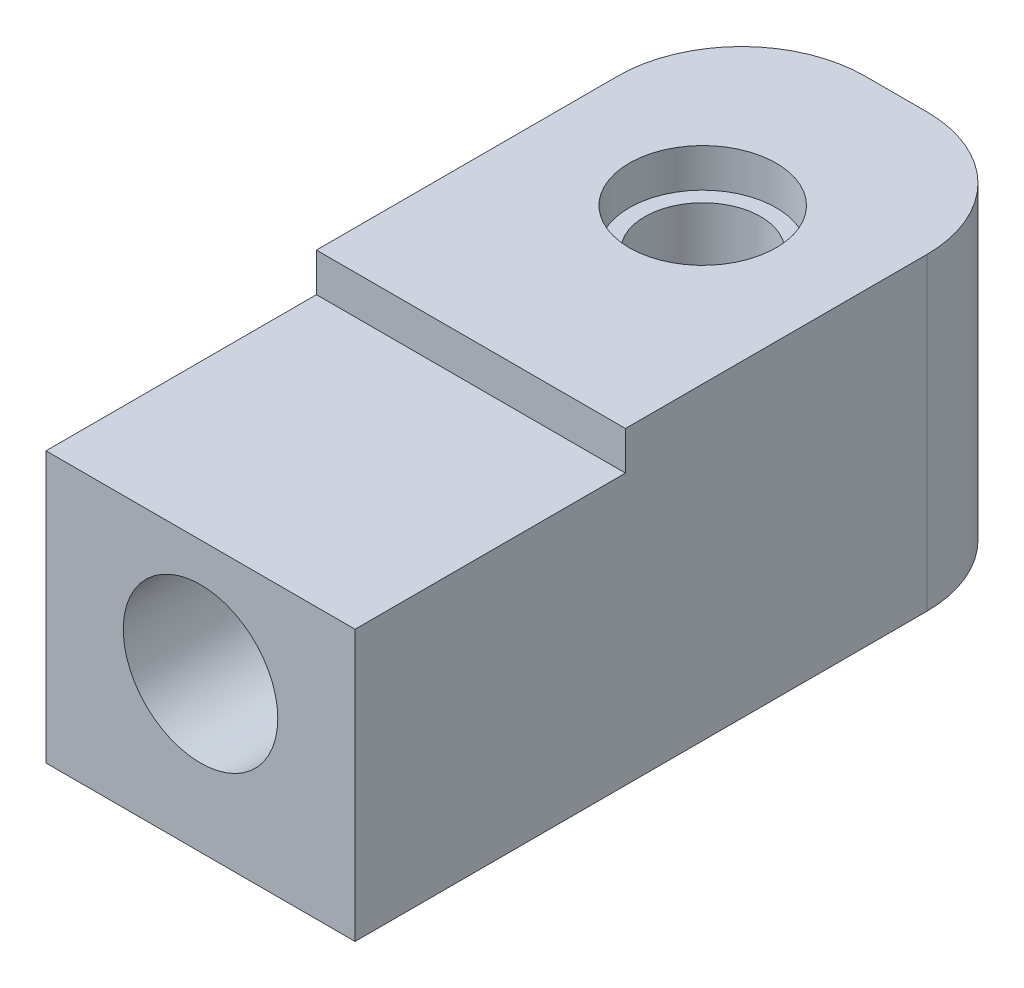
ISO-10303-21;
HEADER;
FILE_DESCRIPTION(('STEP AP214'),'2;1');
FILE_NAME('part.step','',(''),(''),'','','');
FILE_SCHEMA(('AUTOMOTIVE_DESIGN { 1 0 10303 214 1 1 1 1 }'));
ENDSEC;
DATA;
#1=APPLICATION_CONTEXT('core data for automotive mechanical design processes');
#2=APPLICATION_PROTOCOL_DEFINITION('international standard','automotive_design',2000,#1);
#3=PRODUCT_CONTEXT('',#1,'mechanical');
#4=PRODUCT('Part','Part','',(#3));
#5=PRODUCT_RELATED_PRODUCT_CATEGORY('part','',(#4));
#6=PRODUCT_DEFINITION_FORMATION('','',#4);
#7=PRODUCT_DEFINITION_CONTEXT('part definition',#1,'design');
#8=PRODUCT_DEFINITION('design','',#6,#7);
#9=PRODUCT_DEFINITION_SHAPE('','',#8);
#10=(LENGTH_UNIT() NAMED_UNIT(*) SI_UNIT(.MILLI.,.METRE.));
#11=(NAMED_UNIT(*) PLANE_ANGLE_UNIT() SI_UNIT($,.RADIAN.));
#12=(NAMED_UNIT(*) SI_UNIT($,.STERADIAN.) SOLID_ANGLE_UNIT());
#13=UNCERTAINTY_MEASURE_WITH_UNIT(LENGTH_MEASURE(1.E-05),#10,'distance_accuracy_value','');
#14=(GEOMETRIC_REPRESENTATION_CONTEXT(3) GLOBAL_UNCERTAINTY_ASSIGNED_CONTEXT((#13)) GLOBAL_UNIT_ASSIGNED_CONTEXT((#10,
#11,#12)) REPRESENTATION_CONTEXT('',''));
#15=CARTESIAN_POINT('',(0.,0.,0.));
#16=DIRECTION('',(0.,0.,1.));
#17=DIRECTION('',(1.,0.,0.));
#18=AXIS2_PLACEMENT_3D('',#15,#16,#17);
#19=CARTESIAN_POINT('',(5.,10.,-7.24999999999999));
#20=DIRECTION('',(-1.,0.,0.));
#21=DIRECTION('',(0.,0.,1.));
#22=AXIS2_PLACEMENT_3D('',#19,#20,#21);
#23=PLANE('',#22);
#24=DIRECTION('',(0.,0.,-1.));
#25=VECTOR('',#24,1.);
#26=CARTESIAN_POINT('',(5.,10.,-7.24999999999999));
#27=LINE('',#26,#25);
#28=CARTESIAN_POINT('',(5.,10.,2.50000000000001));
#29=VERTEX_POINT('',#28);
#30=CARTESIAN_POINT('',(5.,10.,-7.24999999999999));
#31=VERTEX_POINT('',#30);
#32=EDGE_CURVE('E90',#29,#31,#27,.T.);
#33=ORIENTED_EDGE('',*,*,#32,.F.);
#34=DIRECTION('',(0.,1.,0.));
#35=VECTOR('',#34,1.);
#36=CARTESIAN_POINT('',(5.,8.75,2.50000000000001));
#37=LINE('',#36,#35);
#38=CARTESIAN_POINT('',(5.,8.75,2.50000000000001));
#39=VERTEX_POINT('',#38);
#40=EDGE_CURVE('E47',#39,#29,#37,.T.);
#41=ORIENTED_EDGE('',*,*,#40,.F.);
#42=DIRECTION('',(0.,0.,-1.));
#43=VECTOR('',#42,1.);
#44=CARTESIAN_POINT('',(5.,8.75,11.25));
#45=LINE('',#44,#43);
#46=CARTESIAN_POINT('',(5.,8.75,11.25));
#47=VERTEX_POINT('',#46);
#48=EDGE_CURVE('E122',#47,#39,#45,.T.);
#49=ORIENTED_EDGE('',*,*,#48,.F.);
#50=DIRECTION('',(0.,-1.,0.));
#51=VECTOR('',#50,1.);
#52=CARTESIAN_POINT('',(5.,10.,11.25));
#53=LINE('',#52,#51);
#54=CARTESIAN_POINT('',(5.,0.,11.25));
#55=VERTEX_POINT('',#54);
#56=EDGE_CURVE('E84',#47,#55,#53,.T.);
#57=ORIENTED_EDGE('',*,*,#56,.T.);
#58=DIRECTION('',(0.,0.,-1.));
#59=VECTOR('',#58,1.);
#60=CARTESIAN_POINT('',(5.,0.,-7.24999999999999));
#61=LINE('',#60,#59);
#62=CARTESIAN_POINT('',(5.,0.,-7.24999999999999));
#63=VERTEX_POINT('',#62);
#64=EDGE_CURVE('E156',#55,#63,#61,.T.);
#65=ORIENTED_EDGE('',*,*,#64,.T.);
#66=DIRECTION('',(0.,-1.,0.));
#67=VECTOR('',#66,1.);
#68=CARTESIAN_POINT('',(5.,10.,-7.24999999999999));
#69=LINE('',#68,#67);
#70=EDGE_CURVE('E11',#31,#63,#69,.T.);
#71=ORIENTED_EDGE('',*,*,#70,.F.);
#72=EDGE_LOOP('',(#33,#41,#49,#57,#65,#71));
#73=FACE_BOUND('',#72,.T.);
#74=ADVANCED_FACE('F33',(#73),#23,.F.);
#75=CARTESIAN_POINT('',(0.999999999999997,10.,-7.24999999999999));
#76=DIRECTION('',(0.,-1.,0.));
#77=DIRECTION('',(0.,0.,-1.));
#78=AXIS2_PLACEMENT_3D('',#75,#76,#77);
#79=CYLINDRICAL_SURFACE('',#78,4.);
#80=CARTESIAN_POINT('',(0.999999999999997,0.,-7.24999999999999));
#81=DIRECTION('',(0.,1.,0.));
#82=DIRECTION('',(0.,0.,1.));
#83=AXIS2_PLACEMENT_3D('',#80,#81,#82);
#84=CIRCLE('',#83,4.);
#85=CARTESIAN_POINT('',(0.999999999999997,0.,-11.25));
#86=VERTEX_POINT('',#85);
#87=EDGE_CURVE('E152',#63,#86,#84,.T.);
#88=ORIENTED_EDGE('',*,*,#87,.T.);
#89=DIRECTION('',(0.,-1.,0.));
#90=VECTOR('',#89,1.);
#91=CARTESIAN_POINT('',(0.999999999999997,10.,-11.25));
#92=LINE('',#91,#90);
#93=CARTESIAN_POINT('',(0.999999999999997,10.,-11.25));
#94=VERTEX_POINT('',#93);
#95=EDGE_CURVE('E40',#94,#86,#92,.T.);
#96=ORIENTED_EDGE('',*,*,#95,.F.);
#97=CARTESIAN_POINT('',(0.999999999999997,10.,-7.24999999999999));
#98=DIRECTION('',(0.,1.,0.));
#99=DIRECTION('',(0.,0.,1.));
#100=AXIS2_PLACEMENT_3D('',#97,#98,#99);
#101=CIRCLE('',#100,4.);
#102=EDGE_CURVE('E161',#31,#94,#101,.T.);
#103=ORIENTED_EDGE('',*,*,#102,.F.);
#104=ORIENTED_EDGE('',*,*,#70,.T.);
#105=EDGE_LOOP('',(#88,#96,#103,#104));
#106=FACE_BOUND('',#105,.T.);
#107=ADVANCED_FACE('F198',(#106),#79,.T.);
#108=CARTESIAN_POINT('',(-0.999999999999997,10.,-11.25));
#109=DIRECTION('',(0.,0.,1.));
#110=DIRECTION('',(1.,0.,0.));
#111=AXIS2_PLACEMENT_3D('',#108,#109,#110);
#112=PLANE('',#111);
#113=DIRECTION('',(-1.,0.,0.));
#114=VECTOR('',#113,1.);
#115=CARTESIAN_POINT('',(-0.999999999999997,0.,-11.25));
#116=LINE('',#115,#114);
#117=CARTESIAN_POINT('',(-0.999999999999997,0.,-11.25));
#118=VERTEX_POINT('',#117);
#119=EDGE_CURVE('E145',#86,#118,#116,.T.);
#120=ORIENTED_EDGE('',*,*,#119,.T.);
#121=DIRECTION('',(0.,-1.,0.));
#122=VECTOR('',#121,1.);
#123=CARTESIAN_POINT('',(-0.999999999999997,10.,-11.25));
#124=LINE('',#123,#122);
#125=CARTESIAN_POINT('',(-0.999999999999997,10.,-11.25));
#126=VERTEX_POINT('',#125);
#127=EDGE_CURVE('E131',#126,#118,#124,.T.);
#128=ORIENTED_EDGE('',*,*,#127,.F.);
#129=DIRECTION('',(-1.,0.,0.));
#130=VECTOR('',#129,1.);
#131=CARTESIAN_POINT('',(-0.999999999999997,10.,-11.25));
#132=LINE('',#131,#130);
#133=EDGE_CURVE('E146',#94,#126,#132,.T.);
#134=ORIENTED_EDGE('',*,*,#133,.F.);
#135=ORIENTED_EDGE('',*,*,#95,.T.);
#136=EDGE_LOOP('',(#120,#128,#134,#135));
#137=FACE_BOUND('',#136,.T.);
#138=ADVANCED_FACE('F143',(#137),#112,.F.);
#139=CARTESIAN_POINT('',(-0.999999999999997,10.,-7.24999999999999));
#140=DIRECTION('',(0.,-1.,0.));
#141=DIRECTION('',(0.,0.,-1.));
#142=AXIS2_PLACEMENT_3D('',#139,#140,#141);
#143=CYLINDRICAL_SURFACE('',#142,4.);
#144=CARTESIAN_POINT('',(-0.999999999999997,0.,-7.24999999999999));
#145=DIRECTION('',(0.,1.,0.));
#146=DIRECTION('',(0.,0.,-1.));
#147=AXIS2_PLACEMENT_3D('',#144,#145,#146);
#148=CIRCLE('',#147,4.);
#149=CARTESIAN_POINT('',(-5.,0.,-7.24999999999999));
#150=VERTEX_POINT('',#149);
#151=EDGE_CURVE('E153',#118,#150,#148,.T.);
#152=ORIENTED_EDGE('',*,*,#151,.T.);
#153=DIRECTION('',(0.,-1.,0.));
#154=VECTOR('',#153,1.);
#155=CARTESIAN_POINT('',(-5.,10.,-7.24999999999999));
#156=LINE('',#155,#154);
#157=CARTESIAN_POINT('',(-5.,10.,-7.24999999999999));
#158=VERTEX_POINT('',#157);
#159=EDGE_CURVE('E129',#158,#150,#156,.T.);
#160=ORIENTED_EDGE('',*,*,#159,.F.);
#161=CARTESIAN_POINT('',(-0.999999999999997,10.,-7.24999999999999));
#162=DIRECTION('',(0.,1.,0.));
#163=DIRECTION('',(0.,0.,-1.));
#164=AXIS2_PLACEMENT_3D('',#161,#162,#163);
#165=CIRCLE('',#164,4.);
#166=EDGE_CURVE('E56',#126,#158,#165,.T.);
#167=ORIENTED_EDGE('',*,*,#166,.F.);
#168=ORIENTED_EDGE('',*,*,#127,.T.);
#169=EDGE_LOOP('',(#152,#160,#167,#168));
#170=FACE_BOUND('',#169,.T.);
#171=ADVANCED_FACE('F201',(#170),#143,.T.);
#172=CARTESIAN_POINT('',(-5.,10.,-7.24999999999999));
#173=DIRECTION('',(1.,0.,0.));
#174=DIRECTION('',(0.,0.,-1.));
#175=AXIS2_PLACEMENT_3D('',#172,#173,#174);
#176=PLANE('',#175);
#177=DIRECTION('',(0.,0.,1.));
#178=VECTOR('',#177,1.);
#179=CARTESIAN_POINT('',(-5.,8.75,11.25));
#180=LINE('',#179,#178);
#181=CARTESIAN_POINT('',(-5.,8.75,2.50000000000001));
#182=VERTEX_POINT('',#181);
#183=CARTESIAN_POINT('',(-5.,8.75,11.25));
#184=VERTEX_POINT('',#183);
#185=EDGE_CURVE('E108',#182,#184,#180,.T.);
#186=ORIENTED_EDGE('',*,*,#185,.F.);
#187=DIRECTION('',(0.,1.,0.));
#188=VECTOR('',#187,1.);
#189=CARTESIAN_POINT('',(-5.,8.75,2.50000000000001));
#190=LINE('',#189,#188);
#191=CARTESIAN_POINT('',(-5.,10.,2.50000000000001));
#192=VERTEX_POINT('',#191);
#193=EDGE_CURVE('E170',#182,#192,#190,.T.);
#194=ORIENTED_EDGE('',*,*,#193,.T.);
#195=DIRECTION('',(0.,0.,1.));
#196=VECTOR('',#195,1.);
#197=CARTESIAN_POINT('',(-5.,10.,-7.24999999999999));
#198=LINE('',#197,#196);
#199=EDGE_CURVE('E133',#158,#192,#198,.T.);
#200=ORIENTED_EDGE('',*,*,#199,.F.);
#201=ORIENTED_EDGE('',*,*,#159,.T.);
#202=DIRECTION('',(0.,0.,1.));
#203=VECTOR('',#202,1.);
#204=CARTESIAN_POINT('',(-5.,0.,-7.24999999999999));
#205=LINE('',#204,#203);
#206=CARTESIAN_POINT('',(-5.,0.,11.25));
#207=VERTEX_POINT('',#206);
#208=EDGE_CURVE('E127',#150,#207,#205,.T.);
#209=ORIENTED_EDGE('',*,*,#208,.T.);
#210=DIRECTION('',(0.,-1.,0.));
#211=VECTOR('',#210,1.);
#212=CARTESIAN_POINT('',(-5.,10.,11.25));
#213=LINE('',#212,#211);
#214=EDGE_CURVE('E120',#184,#207,#213,.T.);
#215=ORIENTED_EDGE('',*,*,#214,.F.);
#216=EDGE_LOOP('',(#186,#194,#200,#201,#209,#215));
#217=FACE_BOUND('',#216,.T.);
#218=ADVANCED_FACE('F124',(#217),#176,.F.);
#219=CARTESIAN_POINT('',(-5.,10.,11.25));
#220=DIRECTION('',(0.,0.,-1.));
#221=DIRECTION('',(-1.,0.,0.));
#222=AXIS2_PLACEMENT_3D('',#219,#220,#221);
#223=PLANE('',#222);
#224=CARTESIAN_POINT('',(0.,5.,11.25));
#225=DIRECTION('',(0.,0.,1.));
#226=DIRECTION('',(1.,0.,0.));
#227=AXIS2_PLACEMENT_3D('',#224,#225,#226);
#228=CIRCLE('',#227,2.5);
#229=CARTESIAN_POINT('',(2.5,5.,11.25));
#230=VERTEX_POINT('',#229);
#231=EDGE_CURVE('E194',#230,#230,#228,.T.);
#232=ORIENTED_EDGE('',*,*,#231,.F.);
#233=EDGE_LOOP('',(#232));
#234=FACE_BOUND('',#233,.T.);
#235=ORIENTED_EDGE('',*,*,#56,.F.);
#236=DIRECTION('',(1.,0.,0.));
#237=VECTOR('',#236,1.);
#238=CARTESIAN_POINT('',(-5.,8.75,11.25));
#239=LINE('',#238,#237);
#240=EDGE_CURVE('E111',#184,#47,#239,.T.);
#241=ORIENTED_EDGE('',*,*,#240,.F.);
#242=ORIENTED_EDGE('',*,*,#214,.T.);
#243=DIRECTION('',(1.,0.,0.));
#244=VECTOR('',#243,1.);
#245=CARTESIAN_POINT('',(-5.,0.,11.25));
#246=LINE('',#245,#244);
#247=EDGE_CURVE('E160',#207,#55,#246,.T.);
#248=ORIENTED_EDGE('',*,*,#247,.T.);
#249=EDGE_LOOP('',(#235,#241,#242,#248));
#250=FACE_BOUND('',#249,.T.);
#251=ADVANCED_FACE('F119',(#234,#250),#223,.F.);
#252=CARTESIAN_POINT('',(-0.999999999999997,10.,-7.24999999999999));
#253=DIRECTION('',(0.,-1.,0.));
#254=DIRECTION('',(0.,0.,-1.));
#255=AXIS2_PLACEMENT_3D('',#252,#253,#254);
#256=PLANE('',#255);
#257=CARTESIAN_POINT('',(0.,10.,-4.99999999999999));
#258=DIRECTION('',(0.,1.,0.));
#259=DIRECTION('',(0.,0.,1.));
#260=AXIS2_PLACEMENT_3D('',#257,#258,#259);
#261=CIRCLE('',#260,2.375);
#262=CARTESIAN_POINT('',(0.,10.,-2.62499999999999));
#263=VERTEX_POINT('',#262);
#264=EDGE_CURVE('E165',#263,#263,#261,.T.);
#265=ORIENTED_EDGE('',*,*,#264,.F.);
#266=EDGE_LOOP('',(#265));
#267=FACE_BOUND('',#266,.T.);
#268=ORIENTED_EDGE('',*,*,#199,.T.);
#269=DIRECTION('',(-1.,0.,0.));
#270=VECTOR('',#269,1.);
#271=CARTESIAN_POINT('',(-5.,10.,2.50000000000001));
#272=LINE('',#271,#270);
#273=EDGE_CURVE('E116',#29,#192,#272,.T.);
#274=ORIENTED_EDGE('',*,*,#273,.F.);
#275=ORIENTED_EDGE('',*,*,#32,.T.);
#276=ORIENTED_EDGE('',*,*,#102,.T.);
#277=ORIENTED_EDGE('',*,*,#133,.T.);
#278=ORIENTED_EDGE('',*,*,#166,.T.);
#279=EDGE_LOOP('',(#268,#274,#275,#276,#277,#278));
#280=FACE_BOUND('',#279,.T.);
#281=ADVANCED_FACE('F199',(#267,#280),#256,.F.);
#282=CARTESIAN_POINT('',(-0.999999999999997,0.,-7.24999999999999));
#283=DIRECTION('',(0.,-1.,0.));
#284=DIRECTION('',(0.,0.,-1.));
#285=AXIS2_PLACEMENT_3D('',#282,#283,#284);
#286=PLANE('',#285);
#287=CARTESIAN_POINT('',(0.,0.,-4.99999999999999));
#288=DIRECTION('',(0.,-1.,0.));
#289=DIRECTION('',(0.,0.,-1.));
#290=AXIS2_PLACEMENT_3D('',#287,#288,#289);
#291=CIRCLE('',#290,1.875);
#292=CARTESIAN_POINT('',(0.,0.,-6.87499999999999));
#293=VERTEX_POINT('',#292);
#294=EDGE_CURVE('E186',#293,#293,#291,.F.);
#295=ORIENTED_EDGE('',*,*,#294,.T.);
#296=EDGE_LOOP('',(#295));
#297=FACE_BOUND('',#296,.T.);
#298=ORIENTED_EDGE('',*,*,#64,.F.);
#299=ORIENTED_EDGE('',*,*,#247,.F.);
#300=ORIENTED_EDGE('',*,*,#208,.F.);
#301=ORIENTED_EDGE('',*,*,#151,.F.);
#302=ORIENTED_EDGE('',*,*,#119,.F.);
#303=ORIENTED_EDGE('',*,*,#87,.F.);
#304=EDGE_LOOP('',(#298,#299,#300,#301,#302,#303));
#305=FACE_BOUND('',#304,.T.);
#306=ADVANCED_FACE('F151',(#297,#305),#286,.T.);
#307=CARTESIAN_POINT('',(0.,8.75,-4.99999999999999));
#308=DIRECTION('',(0.,1.,0.));
#309=DIRECTION('',(0.,0.,1.));
#310=AXIS2_PLACEMENT_3D('',#307,#308,#309);
#311=CYLINDRICAL_SURFACE('',#310,2.375);
#312=CARTESIAN_POINT('',(0.,8.75,-4.99999999999999));
#313=DIRECTION('',(0.,1.,0.));
#314=DIRECTION('',(0.,0.,1.));
#315=AXIS2_PLACEMENT_3D('',#312,#313,#314);
#316=CIRCLE('',#315,2.375);
#317=CARTESIAN_POINT('',(0.,8.75,-2.62499999999999));
#318=VERTEX_POINT('',#317);
#319=EDGE_CURVE('E177',#318,#318,#316,.T.);
#320=ORIENTED_EDGE('',*,*,#319,.F.);
#321=EDGE_LOOP('',(#320));
#322=FACE_BOUND('',#321,.T.);
#323=ORIENTED_EDGE('',*,*,#264,.T.);
#324=EDGE_LOOP('',(#323));
#325=FACE_BOUND('',#324,.T.);
#326=ADVANCED_FACE('F252',(#322,#325),#311,.F.);
#327=CARTESIAN_POINT('',(0.,8.75,-4.99999999999999));
#328=DIRECTION('',(0.,1.,0.));
#329=DIRECTION('',(0.,0.,1.));
#330=AXIS2_PLACEMENT_3D('',#327,#328,#329);
#331=PLANE('',#330);
#332=CARTESIAN_POINT('',(0.,8.75,-4.99999999999999));
#333=DIRECTION('',(0.,1.,0.));
#334=DIRECTION('',(0.,0.,1.));
#335=AXIS2_PLACEMENT_3D('',#332,#333,#334);
#336=CIRCLE('',#335,1.875);
#337=CARTESIAN_POINT('',(0.,8.75,-3.12499999999999));
#338=VERTEX_POINT('',#337);
#339=EDGE_CURVE('E182',#338,#338,#336,.T.);
#340=ORIENTED_EDGE('',*,*,#339,.F.);
#341=EDGE_LOOP('',(#340));
#342=FACE_BOUND('',#341,.T.);
#343=ORIENTED_EDGE('',*,*,#319,.T.);
#344=EDGE_LOOP('',(#343));
#345=FACE_BOUND('',#344,.T.);
#346=ADVANCED_FACE('F257',(#342,#345),#331,.T.);
#347=CARTESIAN_POINT('',(-5.,8.75,2.50000000000001));
#348=DIRECTION('',(0.,0.,-1.));
#349=DIRECTION('',(-1.,0.,0.));
#350=AXIS2_PLACEMENT_3D('',#347,#348,#349);
#351=PLANE('',#350);
#352=ORIENTED_EDGE('',*,*,#273,.T.);
#353=ORIENTED_EDGE('',*,*,#193,.F.);
#354=DIRECTION('',(-1.,0.,0.));
#355=VECTOR('',#354,1.);
#356=CARTESIAN_POINT('',(-5.,8.75,2.50000000000001));
#357=LINE('',#356,#355);
#358=EDGE_CURVE('E112',#39,#182,#357,.T.);
#359=ORIENTED_EDGE('',*,*,#358,.F.);
#360=ORIENTED_EDGE('',*,*,#40,.T.);
#361=EDGE_LOOP('',(#352,#353,#359,#360));
#362=FACE_BOUND('',#361,.T.);
#363=ADVANCED_FACE('F197',(#362),#351,.F.);
#364=CARTESIAN_POINT('',(0.,8.75,0.));
#365=DIRECTION('',(0.,-1.,0.));
#366=DIRECTION('',(0.,0.,-1.));
#367=AXIS2_PLACEMENT_3D('',#364,#365,#366);
#368=PLANE('',#367);
#369=ORIENTED_EDGE('',*,*,#185,.T.);
#370=ORIENTED_EDGE('',*,*,#240,.T.);
#371=ORIENTED_EDGE('',*,*,#48,.T.);
#372=ORIENTED_EDGE('',*,*,#358,.T.);
#373=EDGE_LOOP('',(#369,#370,#371,#372));
#374=FACE_BOUND('',#373,.T.);
#375=ADVANCED_FACE('F110',(#374),#368,.F.);
#376=CARTESIAN_POINT('',(0.,-0.000999999999999265,-4.99999999999999));
#377=DIRECTION('',(0.,1.,0.));
#378=DIRECTION('',(0.,0.,1.));
#379=AXIS2_PLACEMENT_3D('',#376,#377,#378);
#380=CYLINDRICAL_SURFACE('',#379,1.875);
#381=ORIENTED_EDGE('',*,*,#294,.F.);
#382=EDGE_LOOP('',(#381));
#383=FACE_BOUND('',#382,.T.);
#384=ORIENTED_EDGE('',*,*,#339,.T.);
#385=EDGE_LOOP('',(#384));
#386=FACE_BOUND('',#385,.T.);
#387=ADVANCED_FACE('F277',(#383,#386),#380,.F.);
#388=CARTESIAN_POINT('',(0.,5.,-0.62999999999999));
#389=DIRECTION('',(0.,0.,1.));
#390=DIRECTION('',(1.,0.,0.));
#391=AXIS2_PLACEMENT_3D('',#388,#389,#390);
#392=CYLINDRICAL_SURFACE('',#391,2.5);
#393=CARTESIAN_POINT('',(0.,5.,-0.62999999999999));
#394=DIRECTION('',(0.,0.,1.));
#395=DIRECTION('',(1.,0.,0.));
#396=AXIS2_PLACEMENT_3D('',#393,#394,#395);
#397=CIRCLE('',#396,2.5);
#398=CARTESIAN_POINT('',(2.5,5.,-0.62999999999999));
#399=VERTEX_POINT('',#398);
#400=EDGE_CURVE('E191',#399,#399,#397,.T.);
#401=ORIENTED_EDGE('',*,*,#400,.F.);
#402=EDGE_LOOP('',(#401));
#403=FACE_BOUND('',#402,.T.);
#404=ORIENTED_EDGE('',*,*,#231,.T.);
#405=EDGE_LOOP('',(#404));
#406=FACE_BOUND('',#405,.T.);
#407=ADVANCED_FACE('F300',(#403,#406),#392,.F.);
#408=CARTESIAN_POINT('',(0.,5.,-0.62999999999999));
#409=DIRECTION('',(0.,0.,1.));
#410=DIRECTION('',(1.,0.,0.));
#411=AXIS2_PLACEMENT_3D('',#408,#409,#410);
#412=PLANE('',#411);
#413=ORIENTED_EDGE('',*,*,#400,.T.);
#414=EDGE_LOOP('',(#413));
#415=FACE_BOUND('',#414,.T.);
#416=ADVANCED_FACE('F317',(#415),#412,.T.);
#417=CLOSED_SHELL('',(#74,#107,#138,#171,#218,#251,#281,#306,#326,#346,#363,#375,#387,#407,#416));
#418=MANIFOLD_SOLID_BREP('B2',#417);
#419=ADVANCED_BREP_SHAPE_REPRESENTATION('',(#18,#418),#14);
#420=SHAPE_DEFINITION_REPRESENTATION(#9,#419);
ENDSEC;
END-ISO-10303-21;
